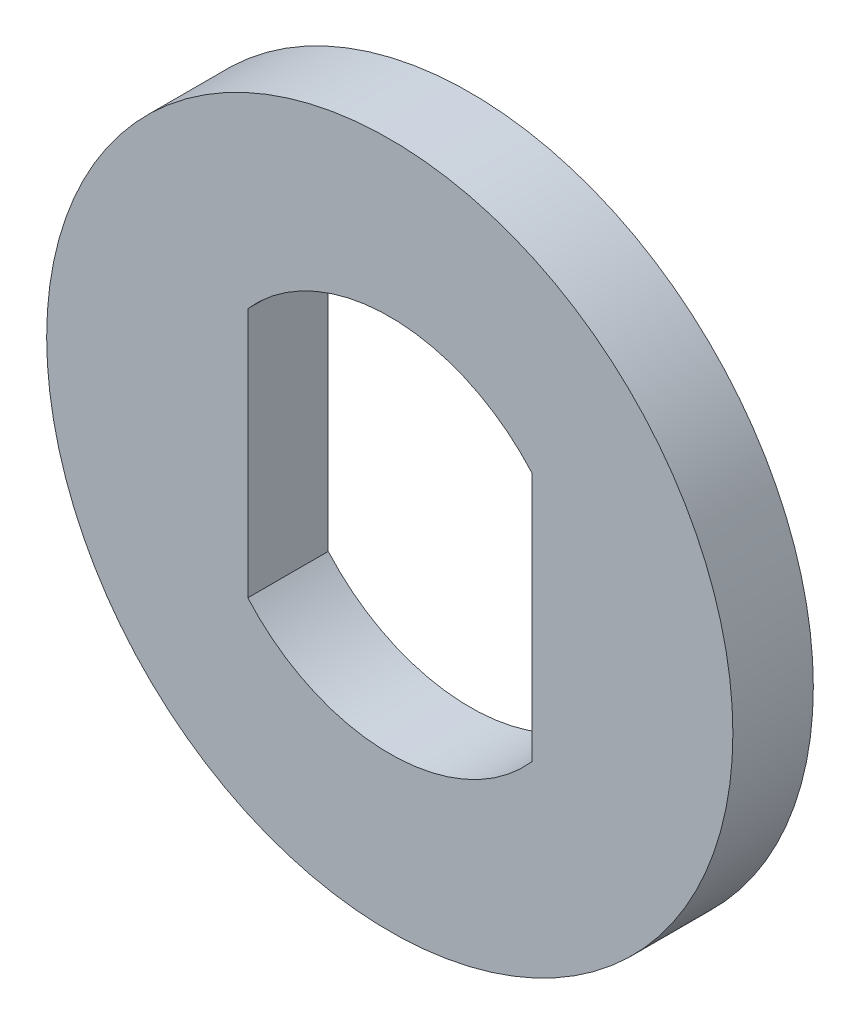
ISO-10303-21;
HEADER;
FILE_DESCRIPTION(('STEP AP214'),'2;1');
FILE_NAME('part.step','',(''),(''),'','','');
FILE_SCHEMA(('AUTOMOTIVE_DESIGN { 1 0 10303 214 1 1 1 1 }'));
ENDSEC;
DATA;
#1=APPLICATION_CONTEXT('core data for automotive mechanical design processes');
#2=APPLICATION_PROTOCOL_DEFINITION('international standard','automotive_design',2000,#1);
#3=PRODUCT_CONTEXT('',#1,'mechanical');
#4=PRODUCT('Part','Part','',(#3));
#5=PRODUCT_RELATED_PRODUCT_CATEGORY('part','',(#4));
#6=PRODUCT_DEFINITION_FORMATION('','',#4);
#7=PRODUCT_DEFINITION_CONTEXT('part definition',#1,'design');
#8=PRODUCT_DEFINITION('design','',#6,#7);
#9=PRODUCT_DEFINITION_SHAPE('','',#8);
#10=(LENGTH_UNIT() NAMED_UNIT(*) SI_UNIT(.MILLI.,.METRE.));
#11=(NAMED_UNIT(*) PLANE_ANGLE_UNIT() SI_UNIT($,.RADIAN.));
#12=(NAMED_UNIT(*) SI_UNIT($,.STERADIAN.) SOLID_ANGLE_UNIT());
#13=UNCERTAINTY_MEASURE_WITH_UNIT(LENGTH_MEASURE(1.E-05),#10,'distance_accuracy_value','');
#14=(GEOMETRIC_REPRESENTATION_CONTEXT(3) GLOBAL_UNCERTAINTY_ASSIGNED_CONTEXT((#13)) GLOBAL_UNIT_ASSIGNED_CONTEXT((#10,
#11,#12)) REPRESENTATION_CONTEXT('',''));
#15=CARTESIAN_POINT('',(0.,0.,0.));
#16=DIRECTION('',(0.,0.,1.));
#17=DIRECTION('',(1.,0.,0.));
#18=AXIS2_PLACEMENT_3D('',#15,#16,#17);
#19=CARTESIAN_POINT('',(0.,0.,0.84999999999999));
#20=DIRECTION('',(0.,0.,1.));
#21=DIRECTION('',(1.,0.,0.));
#22=AXIS2_PLACEMENT_3D('',#19,#20,#21);
#23=PLANE('',#22);
#24=CARTESIAN_POINT('',(0.,0.,0.84999999999999));
#25=DIRECTION('',(0.,0.,1.));
#26=DIRECTION('',(1.,0.,0.));
#27=AXIS2_PLACEMENT_3D('',#24,#25,#26);
#28=CIRCLE('',#27,7.25);
#29=CARTESIAN_POINT('',(7.25,0.,0.84999999999999));
#30=VERTEX_POINT('',#29);
#31=EDGE_CURVE('E11',#30,#30,#28,.T.);
#32=ORIENTED_EDGE('',*,*,#31,.T.);
#33=EDGE_LOOP('',(#32));
#34=FACE_BOUND('',#33,.T.);
#35=DIRECTION('',(0.,1.,0.));
#36=VECTOR('',#35,1.);
#37=CARTESIAN_POINT('',(3.,2.64575131106459,0.84999999999999));
#38=LINE('',#37,#36);
#39=CARTESIAN_POINT('',(3.00000000000001,-2.64575131106459,0.84999999999999));
#40=VERTEX_POINT('',#39);
#41=CARTESIAN_POINT('',(3.,2.64575131106459,0.84999999999999));
#42=VERTEX_POINT('',#41);
#43=EDGE_CURVE('E92',#40,#42,#38,.T.);
#44=ORIENTED_EDGE('',*,*,#43,.F.);
#45=CARTESIAN_POINT('',(0.,0.,0.84999999999999));
#46=DIRECTION('',(0.,0.,1.));
#47=DIRECTION('',(1.,0.,0.));
#48=AXIS2_PLACEMENT_3D('',#45,#46,#47);
#49=CIRCLE('',#48,4.);
#50=CARTESIAN_POINT('',(-3.00000000000001,-2.64575131106459,0.84999999999999));
#51=VERTEX_POINT('',#50);
#52=EDGE_CURVE('E82',#51,#40,#49,.T.);
#53=ORIENTED_EDGE('',*,*,#52,.F.);
#54=DIRECTION('',(0.,-1.,0.));
#55=VECTOR('',#54,1.);
#56=CARTESIAN_POINT('',(-3.00000000000001,2.64575131106459,0.84999999999999));
#57=LINE('',#56,#55);
#58=CARTESIAN_POINT('',(-3.00000000000001,2.64575131106459,0.84999999999999));
#59=VERTEX_POINT('',#58);
#60=EDGE_CURVE('E96',#59,#51,#57,.T.);
#61=ORIENTED_EDGE('',*,*,#60,.F.);
#62=CARTESIAN_POINT('',(0.,0.,0.84999999999999));
#63=DIRECTION('',(0.,0.,1.));
#64=DIRECTION('',(1.,0.,0.));
#65=AXIS2_PLACEMENT_3D('',#62,#63,#64);
#66=CIRCLE('',#65,4.);
#67=EDGE_CURVE('E94',#42,#59,#66,.T.);
#68=ORIENTED_EDGE('',*,*,#67,.F.);
#69=EDGE_LOOP('',(#44,#53,#61,#68));
#70=FACE_BOUND('',#69,.T.);
#71=ADVANCED_FACE('F26',(#34,#70),#23,.T.);
#72=CARTESIAN_POINT('',(0.,0.,-0.84999999999999));
#73=DIRECTION('',(0.,0.,1.));
#74=DIRECTION('',(1.,0.,0.));
#75=AXIS2_PLACEMENT_3D('',#72,#73,#74);
#76=PLANE('',#75);
#77=CARTESIAN_POINT('',(0.,0.,-0.84999999999999));
#78=DIRECTION('',(0.,0.,1.));
#79=DIRECTION('',(1.,0.,0.));
#80=AXIS2_PLACEMENT_3D('',#77,#78,#79);
#81=CIRCLE('',#80,7.25);
#82=CARTESIAN_POINT('',(7.25,0.,-0.84999999999999));
#83=VERTEX_POINT('',#82);
#84=EDGE_CURVE('E34',#83,#83,#81,.T.);
#85=ORIENTED_EDGE('',*,*,#84,.F.);
#86=EDGE_LOOP('',(#85));
#87=FACE_BOUND('',#86,.T.);
#88=CARTESIAN_POINT('',(0.,0.,-0.84999999999999));
#89=DIRECTION('',(0.,0.,1.));
#90=DIRECTION('',(1.,0.,0.));
#91=AXIS2_PLACEMENT_3D('',#88,#89,#90);
#92=CIRCLE('',#91,4.);
#93=CARTESIAN_POINT('',(-3.,-2.64575131106459,-0.84999999999999));
#94=VERTEX_POINT('',#93);
#95=CARTESIAN_POINT('',(3.00000000000001,-2.64575131106459,-0.84999999999999));
#96=VERTEX_POINT('',#95);
#97=EDGE_CURVE('E49',#94,#96,#92,.T.);
#98=ORIENTED_EDGE('',*,*,#97,.T.);
#99=DIRECTION('',(0.,1.,0.));
#100=VECTOR('',#99,1.);
#101=CARTESIAN_POINT('',(3.00000000000001,2.64575131106459,-0.84999999999999));
#102=LINE('',#101,#100);
#103=CARTESIAN_POINT('',(3.00000000000001,2.64575131106459,-0.84999999999999));
#104=VERTEX_POINT('',#103);
#105=EDGE_CURVE('E69',#96,#104,#102,.T.);
#106=ORIENTED_EDGE('',*,*,#105,.T.);
#107=CARTESIAN_POINT('',(0.,0.,-0.84999999999999));
#108=DIRECTION('',(0.,0.,1.));
#109=DIRECTION('',(1.,0.,0.));
#110=AXIS2_PLACEMENT_3D('',#107,#108,#109);
#111=CIRCLE('',#110,4.);
#112=CARTESIAN_POINT('',(-3.00000000000001,2.64575131106459,-0.84999999999999));
#113=VERTEX_POINT('',#112);
#114=EDGE_CURVE('E78',#104,#113,#111,.T.);
#115=ORIENTED_EDGE('',*,*,#114,.T.);
#116=DIRECTION('',(0.,-1.,0.));
#117=VECTOR('',#116,1.);
#118=CARTESIAN_POINT('',(-3.00000000000001,2.64575131106459,-0.84999999999999));
#119=LINE('',#118,#117);
#120=EDGE_CURVE('E86',#113,#94,#119,.T.);
#121=ORIENTED_EDGE('',*,*,#120,.T.);
#122=EDGE_LOOP('',(#98,#106,#115,#121));
#123=FACE_BOUND('',#122,.T.);
#124=ADVANCED_FACE('F85',(#87,#123),#76,.F.);
#125=CARTESIAN_POINT('',(0.,0.,0.84999999999999));
#126=DIRECTION('',(0.,0.,-1.));
#127=DIRECTION('',(-1.,0.,0.));
#128=AXIS2_PLACEMENT_3D('',#125,#126,#127);
#129=CYLINDRICAL_SURFACE('',#128,7.25);
#130=ORIENTED_EDGE('',*,*,#31,.F.);
#131=EDGE_LOOP('',(#130));
#132=FACE_BOUND('',#131,.T.);
#133=ORIENTED_EDGE('',*,*,#84,.T.);
#134=EDGE_LOOP('',(#133));
#135=FACE_BOUND('',#134,.T.);
#136=ADVANCED_FACE('F28',(#132,#135),#129,.T.);
#137=CARTESIAN_POINT('',(0.,0.,0.84999999999999));
#138=DIRECTION('',(0.,0.,-1.));
#139=DIRECTION('',(-1.,0.,0.));
#140=AXIS2_PLACEMENT_3D('',#137,#138,#139);
#141=CYLINDRICAL_SURFACE('',#140,4.);
#142=ORIENTED_EDGE('',*,*,#97,.F.);
#143=DIRECTION('',(0.,0.,-1.));
#144=VECTOR('',#143,1.);
#145=CARTESIAN_POINT('',(-3.00000000000001,-2.64575131106459,0.84999999999999));
#146=LINE('',#145,#144);
#147=EDGE_CURVE('E98',#51,#94,#146,.T.);
#148=ORIENTED_EDGE('',*,*,#147,.F.);
#149=ORIENTED_EDGE('',*,*,#52,.T.);
#150=DIRECTION('',(0.,0.,-1.));
#151=VECTOR('',#150,1.);
#152=CARTESIAN_POINT('',(3.00000000000001,-2.64575131106459,0.84999999999999));
#153=LINE('',#152,#151);
#154=EDGE_CURVE('E71',#40,#96,#153,.T.);
#155=ORIENTED_EDGE('',*,*,#154,.T.);
#156=EDGE_LOOP('',(#142,#148,#149,#155));
#157=FACE_BOUND('',#156,.T.);
#158=ADVANCED_FACE('F80',(#157),#141,.F.);
#159=CARTESIAN_POINT('',(3.,2.64575131106459,0.84999999999999));
#160=DIRECTION('',(-1.,0.,0.));
#161=DIRECTION('',(0.,0.,1.));
#162=AXIS2_PLACEMENT_3D('',#159,#160,#161);
#163=PLANE('',#162);
#164=ORIENTED_EDGE('',*,*,#105,.F.);
#165=ORIENTED_EDGE('',*,*,#154,.F.);
#166=ORIENTED_EDGE('',*,*,#43,.T.);
#167=DIRECTION('',(0.,0.,-1.));
#168=VECTOR('',#167,1.);
#169=CARTESIAN_POINT('',(3.,2.64575131106459,0.84999999999999));
#170=LINE('',#169,#168);
#171=EDGE_CURVE('E74',#42,#104,#170,.T.);
#172=ORIENTED_EDGE('',*,*,#171,.T.);
#173=EDGE_LOOP('',(#164,#165,#166,#172));
#174=FACE_BOUND('',#173,.T.);
#175=ADVANCED_FACE('F70',(#174),#163,.T.);
#176=CARTESIAN_POINT('',(0.,0.,0.84999999999999));
#177=DIRECTION('',(0.,0.,-1.));
#178=DIRECTION('',(-1.,0.,0.));
#179=AXIS2_PLACEMENT_3D('',#176,#177,#178);
#180=CYLINDRICAL_SURFACE('',#179,4.);
#181=ORIENTED_EDGE('',*,*,#114,.F.);
#182=ORIENTED_EDGE('',*,*,#171,.F.);
#183=ORIENTED_EDGE('',*,*,#67,.T.);
#184=DIRECTION('',(0.,0.,-1.));
#185=VECTOR('',#184,1.);
#186=CARTESIAN_POINT('',(-3.00000000000001,2.64575131106459,0.84999999999999));
#187=LINE('',#186,#185);
#188=EDGE_CURVE('E41',#59,#113,#187,.T.);
#189=ORIENTED_EDGE('',*,*,#188,.T.);
#190=EDGE_LOOP('',(#181,#182,#183,#189));
#191=FACE_BOUND('',#190,.T.);
#192=ADVANCED_FACE('F118',(#191),#180,.F.);
#193=CARTESIAN_POINT('',(-3.00000000000001,2.64575131106459,0.84999999999999));
#194=DIRECTION('',(1.,0.,0.));
#195=DIRECTION('',(0.,0.,-1.));
#196=AXIS2_PLACEMENT_3D('',#193,#194,#195);
#197=PLANE('',#196);
#198=ORIENTED_EDGE('',*,*,#120,.F.);
#199=ORIENTED_EDGE('',*,*,#188,.F.);
#200=ORIENTED_EDGE('',*,*,#60,.T.);
#201=ORIENTED_EDGE('',*,*,#147,.T.);
#202=EDGE_LOOP('',(#198,#199,#200,#201));
#203=FACE_BOUND('',#202,.T.);
#204=ADVANCED_FACE('F121',(#203),#197,.T.);
#205=CLOSED_SHELL('',(#71,#124,#136,#158,#175,#192,#204));
#206=MANIFOLD_SOLID_BREP('B2',#205);
#207=ADVANCED_BREP_SHAPE_REPRESENTATION('',(#18,#206),#14);
#208=SHAPE_DEFINITION_REPRESENTATION(#9,#207);
ENDSEC;
END-ISO-10303-21;
